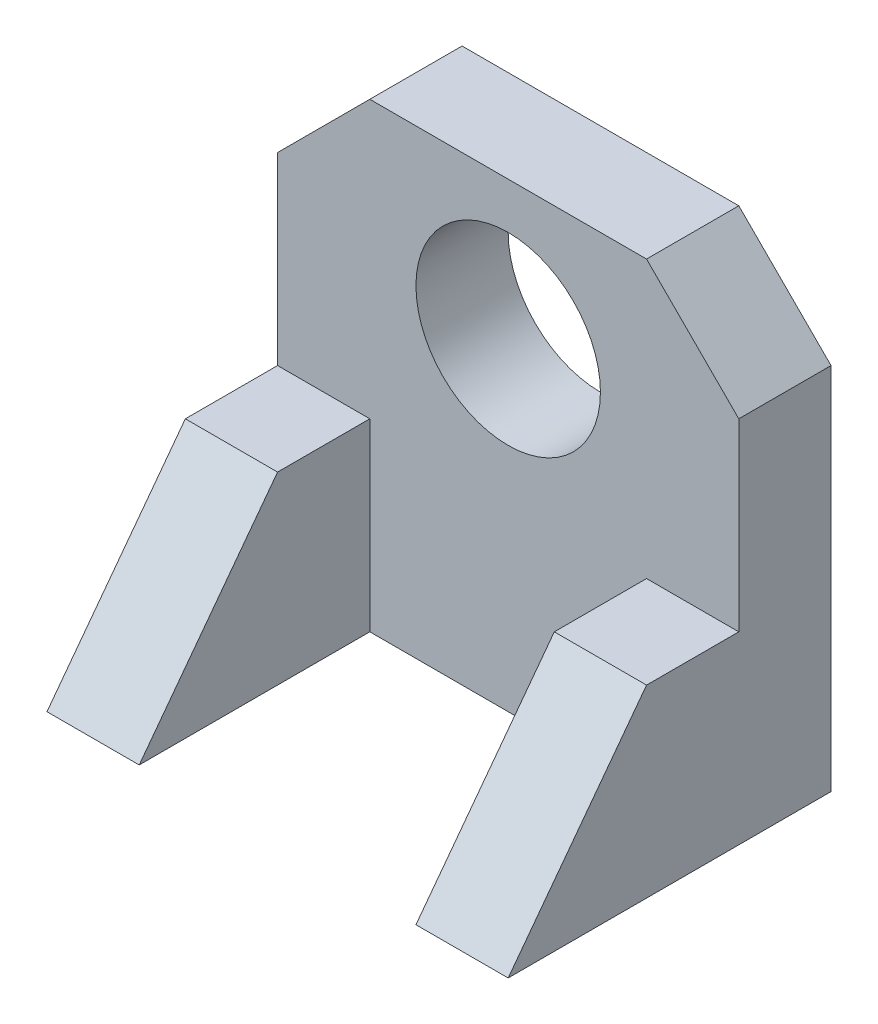
ISO-10303-21;
HEADER;
FILE_DESCRIPTION(('STEP AP214'),'2;1');
FILE_NAME('part.step','',(''),(''),'','','');
FILE_SCHEMA(('AUTOMOTIVE_DESIGN { 1 0 10303 214 1 1 1 1 }'));
ENDSEC;
DATA;
#1=APPLICATION_CONTEXT('core data for automotive mechanical design processes');
#2=APPLICATION_PROTOCOL_DEFINITION('international standard','automotive_design',2000,#1);
#3=PRODUCT_CONTEXT('',#1,'mechanical');
#4=PRODUCT('Part','Part','',(#3));
#5=PRODUCT_RELATED_PRODUCT_CATEGORY('part','',(#4));
#6=PRODUCT_DEFINITION_FORMATION('','',#4);
#7=PRODUCT_DEFINITION_CONTEXT('part definition',#1,'design');
#8=PRODUCT_DEFINITION('design','',#6,#7);
#9=PRODUCT_DEFINITION_SHAPE('','',#8);
#10=(LENGTH_UNIT() NAMED_UNIT(*) SI_UNIT(.MILLI.,.METRE.));
#11=(NAMED_UNIT(*) PLANE_ANGLE_UNIT() SI_UNIT($,.RADIAN.));
#12=(NAMED_UNIT(*) SI_UNIT($,.STERADIAN.) SOLID_ANGLE_UNIT());
#13=UNCERTAINTY_MEASURE_WITH_UNIT(LENGTH_MEASURE(1.E-05),#10,'distance_accuracy_value','');
#14=(GEOMETRIC_REPRESENTATION_CONTEXT(3) GLOBAL_UNCERTAINTY_ASSIGNED_CONTEXT((#13)) GLOBAL_UNIT_ASSIGNED_CONTEXT((#10,
#11,#12)) REPRESENTATION_CONTEXT('',''));
#15=CARTESIAN_POINT('',(0.,0.,0.));
#16=DIRECTION('',(0.,0.,1.));
#17=DIRECTION('',(1.,0.,0.));
#18=AXIS2_PLACEMENT_3D('',#15,#16,#17);
#19=CARTESIAN_POINT('',(0.,0.,0.));
#20=DIRECTION('',(0.,0.,1.));
#21=DIRECTION('',(1.,0.,0.));
#22=AXIS2_PLACEMENT_3D('',#19,#20,#21);
#23=PLANE('',#22);
#24=DIRECTION('',(-1.,0.,0.));
#25=VECTOR('',#24,1.);
#26=CARTESIAN_POINT('',(-15.7516907176508,5.05656245369165,0.));
#27=LINE('',#26,#25);
#28=CARTESIAN_POINT('',(-15.7516907176508,5.05656245369165,0.));
#29=VERTEX_POINT('',#28);
#30=CARTESIAN_POINT('',(-25.7516907176508,5.05656245369165,0.));
#31=VERTEX_POINT('',#30);
#32=EDGE_CURVE('E61',#29,#31,#27,.T.);
#33=ORIENTED_EDGE('',*,*,#32,.F.);
#34=DIRECTION('',(0.,-1.,0.));
#35=VECTOR('',#34,1.);
#36=CARTESIAN_POINT('',(-15.7516907176508,5.05656245369165,0.));
#37=LINE('',#36,#35);
#38=CARTESIAN_POINT('',(-15.7516907176508,-14.9434375463084,0.));
#39=VERTEX_POINT('',#38);
#40=EDGE_CURVE('E65',#29,#39,#37,.T.);
#41=ORIENTED_EDGE('',*,*,#40,.T.);
#42=DIRECTION('',(1.,0.,0.));
#43=VECTOR('',#42,1.);
#44=CARTESIAN_POINT('',(-25.7516907176508,-14.9434375463084,0.));
#45=LINE('',#44,#43);
#46=CARTESIAN_POINT('',(14.2483092823492,-14.9434375463084,0.));
#47=VERTEX_POINT('',#46);
#48=EDGE_CURVE('E155',#39,#47,#45,.T.);
#49=ORIENTED_EDGE('',*,*,#48,.T.);
#50=DIRECTION('',(0.,1.,0.));
#51=VECTOR('',#50,1.);
#52=CARTESIAN_POINT('',(14.2483092823492,5.05656245369163,0.));
#53=LINE('',#52,#51);
#54=CARTESIAN_POINT('',(14.2483092823492,5.05656245369163,0.));
#55=VERTEX_POINT('',#54);
#56=EDGE_CURVE('E174',#47,#55,#53,.T.);
#57=ORIENTED_EDGE('',*,*,#56,.T.);
#58=DIRECTION('',(1.,0.,0.));
#59=VECTOR('',#58,1.);
#60=CARTESIAN_POINT('',(14.2483092823492,5.05656245369163,0.));
#61=LINE('',#60,#59);
#62=CARTESIAN_POINT('',(24.2483092823492,5.05656245369163,0.));
#63=VERTEX_POINT('',#62);
#64=EDGE_CURVE('E190',#55,#63,#61,.T.);
#65=ORIENTED_EDGE('',*,*,#64,.T.);
#66=DIRECTION('',(0.,1.,0.));
#67=VECTOR('',#66,1.);
#68=CARTESIAN_POINT('',(24.2483092823492,25.0565624536917,0.));
#69=LINE('',#68,#67);
#70=CARTESIAN_POINT('',(24.2483092823492,25.0565624536917,0.));
#71=VERTEX_POINT('',#70);
#72=EDGE_CURVE('E212',#63,#71,#69,.T.);
#73=ORIENTED_EDGE('',*,*,#72,.T.);
#74=DIRECTION('',(-0.707106781186548,0.707106781186547,0.));
#75=VECTOR('',#74,1.);
#76=CARTESIAN_POINT('',(14.2483092823492,35.0565624536916,0.));
#77=LINE('',#76,#75);
#78=CARTESIAN_POINT('',(14.2483092823492,35.0565624536916,0.));
#79=VERTEX_POINT('',#78);
#80=EDGE_CURVE('E242',#71,#79,#77,.T.);
#81=ORIENTED_EDGE('',*,*,#80,.T.);
#82=DIRECTION('',(-1.,0.,0.));
#83=VECTOR('',#82,1.);
#84=CARTESIAN_POINT('',(-15.7516907176508,35.0565624536916,0.));
#85=LINE('',#84,#83);
#86=CARTESIAN_POINT('',(-15.7516907176508,35.0565624536916,0.));
#87=VERTEX_POINT('',#86);
#88=EDGE_CURVE('E246',#79,#87,#85,.T.);
#89=ORIENTED_EDGE('',*,*,#88,.T.);
#90=DIRECTION('',(-0.707106781186548,-0.707106781186547,0.));
#91=VECTOR('',#90,1.);
#92=CARTESIAN_POINT('',(-15.7516907176508,35.0565624536916,0.));
#93=LINE('',#92,#91);
#94=CARTESIAN_POINT('',(-25.7516907176508,25.0565624536917,0.));
#95=VERTEX_POINT('',#94);
#96=EDGE_CURVE('E250',#87,#95,#93,.T.);
#97=ORIENTED_EDGE('',*,*,#96,.T.);
#98=DIRECTION('',(0.,-1.,0.));
#99=VECTOR('',#98,1.);
#100=CARTESIAN_POINT('',(-25.7516907176508,25.0565624536917,0.));
#101=LINE('',#100,#99);
#102=EDGE_CURVE('E254',#95,#31,#101,.T.);
#103=ORIENTED_EDGE('',*,*,#102,.T.);
#104=EDGE_LOOP('',(#33,#41,#49,#57,#65,#73,#81,#89,#97,#103));
#105=FACE_BOUND('',#104,.T.);
#106=CARTESIAN_POINT('',(-0.751690717650768,20.0565624536916,0.));
#107=DIRECTION('',(0.,0.,1.));
#108=DIRECTION('',(1.,0.,0.));
#109=AXIS2_PLACEMENT_3D('',#106,#107,#108);
#110=CIRCLE('',#109,10.);
#111=CARTESIAN_POINT('',(9.24830928234924,20.0565624536916,0.));
#112=VERTEX_POINT('',#111);
#113=EDGE_CURVE('E201',#112,#112,#110,.T.);
#114=ORIENTED_EDGE('',*,*,#113,.F.);
#115=EDGE_LOOP('',(#114));
#116=FACE_BOUND('',#115,.T.);
#117=ADVANCED_FACE('F43',(#105,#116),#23,.T.);
#118=CARTESIAN_POINT('',(24.2483092823492,25.0565624536917,-10.));
#119=DIRECTION('',(1.,0.,0.));
#120=DIRECTION('',(0.,1.,0.));
#121=AXIS2_PLACEMENT_3D('',#118,#119,#120);
#122=PLANE('',#121);
#123=ORIENTED_EDGE('',*,*,#72,.F.);
#124=DIRECTION('',(0.,0.,1.));
#125=VECTOR('',#124,1.);
#126=CARTESIAN_POINT('',(24.2483092823492,5.05656245369163,0.));
#127=LINE('',#126,#125);
#128=CARTESIAN_POINT('',(24.2483092823492,5.05656245369163,10.));
#129=VERTEX_POINT('',#128);
#130=EDGE_CURVE('E171',#63,#129,#127,.T.);
#131=ORIENTED_EDGE('',*,*,#130,.T.);
#132=DIRECTION('',(0.,-0.8,0.6));
#133=VECTOR('',#132,1.);
#134=CARTESIAN_POINT('',(24.2483092823492,5.05656245369163,10.));
#135=LINE('',#134,#133);
#136=CARTESIAN_POINT('',(24.2483092823492,-14.9434375463084,25.));
#137=VERTEX_POINT('',#136);
#138=EDGE_CURVE('E179',#129,#137,#135,.T.);
#139=ORIENTED_EDGE('',*,*,#138,.T.);
#140=DIRECTION('',(0.,0.,1.));
#141=VECTOR('',#140,1.);
#142=CARTESIAN_POINT('',(24.2483092823492,-14.9434375463084,-10.));
#143=LINE('',#142,#141);
#144=CARTESIAN_POINT('',(24.2483092823492,-14.9434375463084,-10.));
#145=VERTEX_POINT('',#144);
#146=EDGE_CURVE('E11',#145,#137,#143,.T.);
#147=ORIENTED_EDGE('',*,*,#146,.F.);
#148=DIRECTION('',(0.,1.,0.));
#149=VECTOR('',#148,1.);
#150=CARTESIAN_POINT('',(24.2483092823492,25.0565624536917,-10.));
#151=LINE('',#150,#149);
#152=CARTESIAN_POINT('',(24.2483092823492,25.0565624536917,-10.));
#153=VERTEX_POINT('',#152);
#154=EDGE_CURVE('E216',#145,#153,#151,.T.);
#155=ORIENTED_EDGE('',*,*,#154,.T.);
#156=DIRECTION('',(0.,0.,1.));
#157=VECTOR('',#156,1.);
#158=CARTESIAN_POINT('',(24.2483092823492,25.0565624536917,-10.));
#159=LINE('',#158,#157);
#160=EDGE_CURVE('E47',#153,#71,#159,.T.);
#161=ORIENTED_EDGE('',*,*,#160,.T.);
#162=EDGE_LOOP('',(#123,#131,#139,#147,#155,#161));
#163=FACE_BOUND('',#162,.T.);
#164=ADVANCED_FACE('F45',(#163),#122,.T.);
#165=CARTESIAN_POINT('',(-25.7516907176508,-14.9434375463084,-10.));
#166=DIRECTION('',(0.,-1.,0.));
#167=DIRECTION('',(1.,0.,0.));
#168=AXIS2_PLACEMENT_3D('',#165,#166,#167);
#169=PLANE('',#168);
#170=ORIENTED_EDGE('',*,*,#48,.F.);
#171=DIRECTION('',(0.,0.,1.));
#172=VECTOR('',#171,1.);
#173=CARTESIAN_POINT('',(-15.7516907176508,-14.9434375463084,0.));
#174=LINE('',#173,#172);
#175=CARTESIAN_POINT('',(-15.7516907176508,-14.9434375463084,25.));
#176=VERTEX_POINT('',#175);
#177=EDGE_CURVE('E149',#39,#176,#174,.T.);
#178=ORIENTED_EDGE('',*,*,#177,.T.);
#179=DIRECTION('',(-1.,0.,0.));
#180=VECTOR('',#179,1.);
#181=CARTESIAN_POINT('',(-15.7516907176508,-14.9434375463084,25.));
#182=LINE('',#181,#180);
#183=CARTESIAN_POINT('',(-25.7516907176508,-14.9434375463084,25.));
#184=VERTEX_POINT('',#183);
#185=EDGE_CURVE('E133',#176,#184,#182,.T.);
#186=ORIENTED_EDGE('',*,*,#185,.T.);
#187=DIRECTION('',(0.,0.,1.));
#188=VECTOR('',#187,1.);
#189=CARTESIAN_POINT('',(-25.7516907176508,-14.9434375463084,-10.));
#190=LINE('',#189,#188);
#191=CARTESIAN_POINT('',(-25.7516907176508,-14.9434375463084,-10.));
#192=VERTEX_POINT('',#191);
#193=EDGE_CURVE('E53',#192,#184,#190,.T.);
#194=ORIENTED_EDGE('',*,*,#193,.F.);
#195=DIRECTION('',(1.,0.,0.));
#196=VECTOR('',#195,1.);
#197=CARTESIAN_POINT('',(-25.7516907176508,-14.9434375463084,-10.));
#198=LINE('',#197,#196);
#199=EDGE_CURVE('E236',#192,#145,#198,.T.);
#200=ORIENTED_EDGE('',*,*,#199,.T.);
#201=ORIENTED_EDGE('',*,*,#146,.T.);
#202=DIRECTION('',(1.,0.,0.));
#203=VECTOR('',#202,1.);
#204=CARTESIAN_POINT('',(14.2483092823492,-14.9434375463084,25.));
#205=LINE('',#204,#203);
#206=CARTESIAN_POINT('',(14.2483092823492,-14.9434375463084,25.));
#207=VERTEX_POINT('',#206);
#208=EDGE_CURVE('E197',#207,#137,#205,.T.);
#209=ORIENTED_EDGE('',*,*,#208,.F.);
#210=DIRECTION('',(0.,0.,-1.));
#211=VECTOR('',#210,1.);
#212=CARTESIAN_POINT('',(14.2483092823492,-14.9434375463084,0.));
#213=LINE('',#212,#211);
#214=EDGE_CURVE('E187',#207,#47,#213,.T.);
#215=ORIENTED_EDGE('',*,*,#214,.T.);
#216=EDGE_LOOP('',(#170,#178,#186,#194,#200,#201,#209,#215));
#217=FACE_BOUND('',#216,.T.);
#218=ADVANCED_FACE('F153',(#217),#169,.T.);
#219=CARTESIAN_POINT('',(-25.7516907176508,25.0565624536917,-10.));
#220=DIRECTION('',(-1.,0.,0.));
#221=DIRECTION('',(0.,-1.,0.));
#222=AXIS2_PLACEMENT_3D('',#219,#220,#221);
#223=PLANE('',#222);
#224=ORIENTED_EDGE('',*,*,#102,.F.);
#225=DIRECTION('',(0.,0.,1.));
#226=VECTOR('',#225,1.);
#227=CARTESIAN_POINT('',(-25.7516907176508,25.0565624536917,-10.));
#228=LINE('',#227,#226);
#229=CARTESIAN_POINT('',(-25.7516907176508,25.0565624536917,-10.));
#230=VERTEX_POINT('',#229);
#231=EDGE_CURVE('E261',#230,#95,#228,.T.);
#232=ORIENTED_EDGE('',*,*,#231,.F.);
#233=DIRECTION('',(0.,-1.,0.));
#234=VECTOR('',#233,1.);
#235=CARTESIAN_POINT('',(-25.7516907176508,25.0565624536917,-10.));
#236=LINE('',#235,#234);
#237=EDGE_CURVE('E232',#230,#192,#236,.T.);
#238=ORIENTED_EDGE('',*,*,#237,.T.);
#239=ORIENTED_EDGE('',*,*,#193,.T.);
#240=DIRECTION('',(0.,0.8,-0.6));
#241=VECTOR('',#240,1.);
#242=CARTESIAN_POINT('',(-25.7516907176508,-14.9434375463084,25.));
#243=LINE('',#242,#241);
#244=CARTESIAN_POINT('',(-25.7516907176508,5.05656245369162,10.));
#245=VERTEX_POINT('',#244);
#246=EDGE_CURVE('E139',#184,#245,#243,.T.);
#247=ORIENTED_EDGE('',*,*,#246,.T.);
#248=DIRECTION('',(0.,0.,-1.));
#249=VECTOR('',#248,1.);
#250=CARTESIAN_POINT('',(-25.7516907176508,5.05656245369162,10.));
#251=LINE('',#250,#249);
#252=EDGE_CURVE('E159',#245,#31,#251,.T.);
#253=ORIENTED_EDGE('',*,*,#252,.T.);
#254=EDGE_LOOP('',(#224,#232,#238,#239,#247,#253));
#255=FACE_BOUND('',#254,.T.);
#256=ADVANCED_FACE('F297',(#255),#223,.T.);
#257=CARTESIAN_POINT('',(-15.7516907176508,35.0565624536916,-10.));
#258=DIRECTION('',(-0.707106781186547,0.707106781186548,0.));
#259=DIRECTION('',(-0.707106781186548,-0.707106781186547,0.));
#260=AXIS2_PLACEMENT_3D('',#257,#258,#259);
#261=PLANE('',#260);
#262=ORIENTED_EDGE('',*,*,#96,.F.);
#263=DIRECTION('',(0.,0.,1.));
#264=VECTOR('',#263,1.);
#265=CARTESIAN_POINT('',(-15.7516907176508,35.0565624536916,-10.));
#266=LINE('',#265,#264);
#267=CARTESIAN_POINT('',(-15.7516907176508,35.0565624536916,-10.));
#268=VERTEX_POINT('',#267);
#269=EDGE_CURVE('E264',#268,#87,#266,.T.);
#270=ORIENTED_EDGE('',*,*,#269,.F.);
#271=DIRECTION('',(-0.707106781186548,-0.707106781186547,0.));
#272=VECTOR('',#271,1.);
#273=CARTESIAN_POINT('',(-15.7516907176508,35.0565624536916,-10.));
#274=LINE('',#273,#272);
#275=EDGE_CURVE('E228',#268,#230,#274,.T.);
#276=ORIENTED_EDGE('',*,*,#275,.T.);
#277=ORIENTED_EDGE('',*,*,#231,.T.);
#278=EDGE_LOOP('',(#262,#270,#276,#277));
#279=FACE_BOUND('',#278,.T.);
#280=ADVANCED_FACE('F301',(#279),#261,.T.);
#281=CARTESIAN_POINT('',(-15.7516907176508,35.0565624536916,-10.));
#282=DIRECTION('',(0.,1.,0.));
#283=DIRECTION('',(0.,0.,1.));
#284=AXIS2_PLACEMENT_3D('',#281,#282,#283);
#285=PLANE('',#284);
#286=ORIENTED_EDGE('',*,*,#88,.F.);
#287=DIRECTION('',(0.,0.,1.));
#288=VECTOR('',#287,1.);
#289=CARTESIAN_POINT('',(14.2483092823492,35.0565624536916,-10.));
#290=LINE('',#289,#288);
#291=CARTESIAN_POINT('',(14.2483092823492,35.0565624536916,-10.));
#292=VERTEX_POINT('',#291);
#293=EDGE_CURVE('E266',#292,#79,#290,.T.);
#294=ORIENTED_EDGE('',*,*,#293,.F.);
#295=DIRECTION('',(-1.,0.,0.));
#296=VECTOR('',#295,1.);
#297=CARTESIAN_POINT('',(-15.7516907176508,35.0565624536916,-10.));
#298=LINE('',#297,#296);
#299=EDGE_CURVE('E224',#292,#268,#298,.T.);
#300=ORIENTED_EDGE('',*,*,#299,.T.);
#301=ORIENTED_EDGE('',*,*,#269,.T.);
#302=EDGE_LOOP('',(#286,#294,#300,#301));
#303=FACE_BOUND('',#302,.T.);
#304=ADVANCED_FACE('F303',(#303),#285,.T.);
#305=CARTESIAN_POINT('',(14.2483092823492,35.0565624536916,-10.));
#306=DIRECTION('',(0.707106781186547,0.707106781186548,0.));
#307=DIRECTION('',(-0.707106781186548,0.707106781186547,0.));
#308=AXIS2_PLACEMENT_3D('',#305,#306,#307);
#309=PLANE('',#308);
#310=ORIENTED_EDGE('',*,*,#80,.F.);
#311=ORIENTED_EDGE('',*,*,#160,.F.);
#312=DIRECTION('',(-0.707106781186548,0.707106781186547,0.));
#313=VECTOR('',#312,1.);
#314=CARTESIAN_POINT('',(14.2483092823492,35.0565624536916,-10.));
#315=LINE('',#314,#313);
#316=EDGE_CURVE('E220',#153,#292,#315,.T.);
#317=ORIENTED_EDGE('',*,*,#316,.T.);
#318=ORIENTED_EDGE('',*,*,#293,.T.);
#319=EDGE_LOOP('',(#310,#311,#317,#318));
#320=FACE_BOUND('',#319,.T.);
#321=ADVANCED_FACE('F277',(#320),#309,.T.);
#322=CARTESIAN_POINT('',(0.,0.,-10.));
#323=DIRECTION('',(0.,0.,1.));
#324=DIRECTION('',(1.,0.,0.));
#325=AXIS2_PLACEMENT_3D('',#322,#323,#324);
#326=PLANE('',#325);
#327=CARTESIAN_POINT('',(-0.751690717650768,20.0565624536916,-10.));
#328=DIRECTION('',(0.,0.,1.));
#329=DIRECTION('',(1.,0.,0.));
#330=AXIS2_PLACEMENT_3D('',#327,#328,#329);
#331=CIRCLE('',#330,10.);
#332=CARTESIAN_POINT('',(9.24830928234924,20.0565624536916,-10.));
#333=VERTEX_POINT('',#332);
#334=EDGE_CURVE('E208',#333,#333,#331,.T.);
#335=ORIENTED_EDGE('',*,*,#334,.T.);
#336=EDGE_LOOP('',(#335));
#337=FACE_BOUND('',#336,.T.);
#338=ORIENTED_EDGE('',*,*,#154,.F.);
#339=ORIENTED_EDGE('',*,*,#199,.F.);
#340=ORIENTED_EDGE('',*,*,#237,.F.);
#341=ORIENTED_EDGE('',*,*,#275,.F.);
#342=ORIENTED_EDGE('',*,*,#299,.F.);
#343=ORIENTED_EDGE('',*,*,#316,.F.);
#344=EDGE_LOOP('',(#338,#339,#340,#341,#342,#343));
#345=FACE_BOUND('',#344,.T.);
#346=ADVANCED_FACE('F292',(#337,#345),#326,.F.);
#347=CARTESIAN_POINT('',(-0.751690717650768,20.0565624536916,-10.));
#348=DIRECTION('',(0.,0.,1.));
#349=DIRECTION('',(1.,0.,0.));
#350=AXIS2_PLACEMENT_3D('',#347,#348,#349);
#351=CYLINDRICAL_SURFACE('',#350,10.);
#352=ORIENTED_EDGE('',*,*,#334,.F.);
#353=EDGE_LOOP('',(#352));
#354=FACE_BOUND('',#353,.T.);
#355=ORIENTED_EDGE('',*,*,#113,.T.);
#356=EDGE_LOOP('',(#355));
#357=FACE_BOUND('',#356,.T.);
#358=ADVANCED_FACE('F354',(#354,#357),#351,.F.);
#359=CARTESIAN_POINT('',(14.2483092823492,5.05656245369163,10.));
#360=DIRECTION('',(0.,0.6,0.8));
#361=DIRECTION('',(0.,-0.8,0.6));
#362=AXIS2_PLACEMENT_3D('',#359,#360,#361);
#363=PLANE('',#362);
#364=ORIENTED_EDGE('',*,*,#138,.F.);
#365=DIRECTION('',(1.,0.,0.));
#366=VECTOR('',#365,1.);
#367=CARTESIAN_POINT('',(14.2483092823492,5.05656245369163,10.));
#368=LINE('',#367,#366);
#369=CARTESIAN_POINT('',(14.2483092823492,5.05656245369163,10.));
#370=VERTEX_POINT('',#369);
#371=EDGE_CURVE('E202',#370,#129,#368,.T.);
#372=ORIENTED_EDGE('',*,*,#371,.F.);
#373=DIRECTION('',(0.,-0.8,0.6));
#374=VECTOR('',#373,1.);
#375=CARTESIAN_POINT('',(14.2483092823492,5.05656245369163,10.));
#376=LINE('',#375,#374);
#377=EDGE_CURVE('E183',#370,#207,#376,.T.);
#378=ORIENTED_EDGE('',*,*,#377,.T.);
#379=ORIENTED_EDGE('',*,*,#208,.T.);
#380=EDGE_LOOP('',(#364,#372,#378,#379));
#381=FACE_BOUND('',#380,.T.);
#382=ADVANCED_FACE('F289',(#381),#363,.T.);
#383=CARTESIAN_POINT('',(14.2483092823492,5.05656245369163,0.));
#384=DIRECTION('',(0.,1.,0.));
#385=DIRECTION('',(0.,0.,1.));
#386=AXIS2_PLACEMENT_3D('',#383,#384,#385);
#387=PLANE('',#386);
#388=ORIENTED_EDGE('',*,*,#130,.F.);
#389=ORIENTED_EDGE('',*,*,#64,.F.);
#390=DIRECTION('',(0.,0.,1.));
#391=VECTOR('',#390,1.);
#392=CARTESIAN_POINT('',(14.2483092823492,5.05656245369163,0.));
#393=LINE('',#392,#391);
#394=EDGE_CURVE('E178',#55,#370,#393,.T.);
#395=ORIENTED_EDGE('',*,*,#394,.T.);
#396=ORIENTED_EDGE('',*,*,#371,.T.);
#397=EDGE_LOOP('',(#388,#389,#395,#396));
#398=FACE_BOUND('',#397,.T.);
#399=ADVANCED_FACE('F282',(#398),#387,.T.);
#400=CARTESIAN_POINT('',(14.2483092823492,0.,0.));
#401=DIRECTION('',(-1.,0.,0.));
#402=DIRECTION('',(0.,-1.,0.));
#403=AXIS2_PLACEMENT_3D('',#400,#401,#402);
#404=PLANE('',#403);
#405=ORIENTED_EDGE('',*,*,#56,.F.);
#406=ORIENTED_EDGE('',*,*,#214,.F.);
#407=ORIENTED_EDGE('',*,*,#377,.F.);
#408=ORIENTED_EDGE('',*,*,#394,.F.);
#409=EDGE_LOOP('',(#405,#406,#407,#408));
#410=FACE_BOUND('',#409,.T.);
#411=ADVANCED_FACE('F285',(#410),#404,.T.);
#412=CARTESIAN_POINT('',(-15.7516907176508,5.05656245369162,10.));
#413=DIRECTION('',(0.,1.,0.));
#414=DIRECTION('',(0.,0.,1.));
#415=AXIS2_PLACEMENT_3D('',#412,#413,#414);
#416=PLANE('',#415);
#417=ORIENTED_EDGE('',*,*,#252,.F.);
#418=DIRECTION('',(-1.,0.,0.));
#419=VECTOR('',#418,1.);
#420=CARTESIAN_POINT('',(-15.7516907176508,5.05656245369162,10.));
#421=LINE('',#420,#419);
#422=CARTESIAN_POINT('',(-15.7516907176508,5.05656245369162,10.));
#423=VERTEX_POINT('',#422);
#424=EDGE_CURVE('E143',#423,#245,#421,.T.);
#425=ORIENTED_EDGE('',*,*,#424,.F.);
#426=DIRECTION('',(0.,0.,-1.));
#427=VECTOR('',#426,1.);
#428=CARTESIAN_POINT('',(-15.7516907176508,5.05656245369162,10.));
#429=LINE('',#428,#427);
#430=EDGE_CURVE('E144',#423,#29,#429,.T.);
#431=ORIENTED_EDGE('',*,*,#430,.T.);
#432=ORIENTED_EDGE('',*,*,#32,.T.);
#433=EDGE_LOOP('',(#417,#425,#431,#432));
#434=FACE_BOUND('',#433,.T.);
#435=ADVANCED_FACE('F399',(#434),#416,.T.);
#436=CARTESIAN_POINT('',(-15.7516907176508,-14.9434375463084,25.));
#437=DIRECTION('',(0.,0.6,0.8));
#438=DIRECTION('',(0.,-0.8,0.6));
#439=AXIS2_PLACEMENT_3D('',#436,#437,#438);
#440=PLANE('',#439);
#441=ORIENTED_EDGE('',*,*,#246,.F.);
#442=ORIENTED_EDGE('',*,*,#185,.F.);
#443=DIRECTION('',(0.,0.8,-0.6));
#444=VECTOR('',#443,1.);
#445=CARTESIAN_POINT('',(-15.7516907176508,-14.9434375463084,25.));
#446=LINE('',#445,#444);
#447=EDGE_CURVE('E136',#176,#423,#446,.T.);
#448=ORIENTED_EDGE('',*,*,#447,.T.);
#449=ORIENTED_EDGE('',*,*,#424,.T.);
#450=EDGE_LOOP('',(#441,#442,#448,#449));
#451=FACE_BOUND('',#450,.T.);
#452=ADVANCED_FACE('F135',(#451),#440,.T.);
#453=CARTESIAN_POINT('',(-15.7516907176508,0.,0.));
#454=DIRECTION('',(-1.,0.,0.));
#455=DIRECTION('',(0.,-1.,0.));
#456=AXIS2_PLACEMENT_3D('',#453,#454,#455);
#457=PLANE('',#456);
#458=ORIENTED_EDGE('',*,*,#40,.F.);
#459=ORIENTED_EDGE('',*,*,#430,.F.);
#460=ORIENTED_EDGE('',*,*,#447,.F.);
#461=ORIENTED_EDGE('',*,*,#177,.F.);
#462=EDGE_LOOP('',(#458,#459,#460,#461));
#463=FACE_BOUND('',#462,.T.);
#464=ADVANCED_FACE('F148',(#463),#457,.F.);
#465=CLOSED_SHELL('',(#117,#164,#218,#256,#280,#304,#321,#346,#358,#382,#399,#411,#435,#452,#464));
#466=MANIFOLD_SOLID_BREP('B2',#465);
#467=ADVANCED_BREP_SHAPE_REPRESENTATION('',(#18,#466),#14);
#468=SHAPE_DEFINITION_REPRESENTATION(#9,#467);
ENDSEC;
END-ISO-10303-21;
